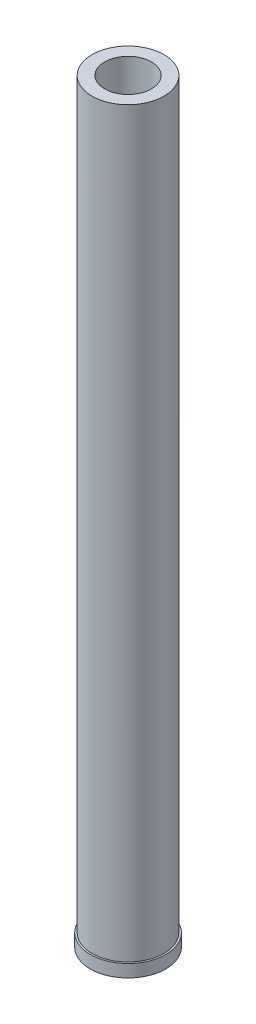
ISO-10303-21;
HEADER;
FILE_DESCRIPTION(('STEP AP214'),'2;1');
FILE_NAME('part.step','',(''),(''),'','','');
FILE_SCHEMA(('AUTOMOTIVE_DESIGN { 1 0 10303 214 1 1 1 1 }'));
ENDSEC;
DATA;
#1=APPLICATION_CONTEXT('core data for automotive mechanical design processes');
#2=APPLICATION_PROTOCOL_DEFINITION('international standard','automotive_design',2000,#1);
#3=PRODUCT_CONTEXT('',#1,'mechanical');
#4=PRODUCT('Part','Part','',(#3));
#5=PRODUCT_RELATED_PRODUCT_CATEGORY('part','',(#4));
#6=PRODUCT_DEFINITION_FORMATION('','',#4);
#7=PRODUCT_DEFINITION_CONTEXT('part definition',#1,'design');
#8=PRODUCT_DEFINITION('design','',#6,#7);
#9=PRODUCT_DEFINITION_SHAPE('','',#8);
#10=(LENGTH_UNIT() NAMED_UNIT(*) SI_UNIT(.MILLI.,.METRE.));
#11=(NAMED_UNIT(*) PLANE_ANGLE_UNIT() SI_UNIT($,.RADIAN.));
#12=(NAMED_UNIT(*) SI_UNIT($,.STERADIAN.) SOLID_ANGLE_UNIT());
#13=UNCERTAINTY_MEASURE_WITH_UNIT(LENGTH_MEASURE(1.E-05),#10,'distance_accuracy_value','');
#14=(GEOMETRIC_REPRESENTATION_CONTEXT(3) GLOBAL_UNCERTAINTY_ASSIGNED_CONTEXT((#13)) GLOBAL_UNIT_ASSIGNED_CONTEXT((#10,
#11,#12)) REPRESENTATION_CONTEXT('',''));
#15=CARTESIAN_POINT('',(0.,0.,0.));
#16=DIRECTION('',(0.,0.,1.));
#17=DIRECTION('',(1.,0.,0.));
#18=AXIS2_PLACEMENT_3D('',#15,#16,#17);
#19=CARTESIAN_POINT('',(0.,300.,0.));
#20=DIRECTION('',(0.,1.,0.));
#21=DIRECTION('',(0.,0.,1.));
#22=AXIS2_PLACEMENT_3D('',#19,#20,#21);
#23=PLANE('',#22);
#24=CARTESIAN_POINT('',(0.,300.,0.));
#25=DIRECTION('',(0.,1.,0.));
#26=DIRECTION('',(0.,0.,1.));
#27=AXIS2_PLACEMENT_3D('',#24,#25,#26);
#28=CIRCLE('',#27,14.3);
#29=CARTESIAN_POINT('',(0.,300.,14.3));
#30=VERTEX_POINT('',#29);
#31=EDGE_CURVE('E10',#30,#30,#28,.T.);
#32=ORIENTED_EDGE('',*,*,#31,.T.);
#33=EDGE_LOOP('',(#32));
#34=FACE_BOUND('',#33,.T.);
#35=CARTESIAN_POINT('',(0.,300.,0.));
#36=DIRECTION('',(0.,1.,0.));
#37=DIRECTION('',(0.,0.,1.));
#38=AXIS2_PLACEMENT_3D('',#35,#36,#37);
#39=CIRCLE('',#38,9.3);
#40=CARTESIAN_POINT('',(0.,300.,9.3));
#41=VERTEX_POINT('',#40);
#42=EDGE_CURVE('E53',#41,#41,#39,.T.);
#43=ORIENTED_EDGE('',*,*,#42,.F.);
#44=EDGE_LOOP('',(#43));
#45=FACE_BOUND('',#44,.T.);
#46=ADVANCED_FACE('F45',(#34,#45),#23,.T.);
#47=CARTESIAN_POINT('',(0.,0.,0.));
#48=DIRECTION('',(0.,1.,0.));
#49=DIRECTION('',(0.,0.,1.));
#50=AXIS2_PLACEMENT_3D('',#47,#48,#49);
#51=PLANE('',#50);
#52=CARTESIAN_POINT('',(0.,0.,0.));
#53=DIRECTION('',(0.,1.,0.));
#54=DIRECTION('',(0.,0.,1.));
#55=AXIS2_PLACEMENT_3D('',#52,#53,#54);
#56=CIRCLE('',#55,9.3);
#57=CARTESIAN_POINT('',(0.,0.,9.3));
#58=VERTEX_POINT('',#57);
#59=EDGE_CURVE('E58',#58,#58,#56,.T.);
#60=ORIENTED_EDGE('',*,*,#59,.T.);
#61=EDGE_LOOP('',(#60));
#62=FACE_BOUND('',#61,.T.);
#63=CARTESIAN_POINT('',(0.,0.,0.));
#64=DIRECTION('',(0.,-1.,0.));
#65=DIRECTION('',(1.,0.,0.));
#66=AXIS2_PLACEMENT_3D('',#63,#64,#65);
#67=CIRCLE('',#66,15.);
#68=CARTESIAN_POINT('',(15.,0.,0.));
#69=VERTEX_POINT('',#68);
#70=EDGE_CURVE('E73',#69,#69,#67,.T.);
#71=ORIENTED_EDGE('',*,*,#70,.T.);
#72=EDGE_LOOP('',(#71));
#73=FACE_BOUND('',#72,.T.);
#74=ADVANCED_FACE('F78',(#62,#73),#51,.F.);
#75=CARTESIAN_POINT('',(0.,300.,0.));
#76=DIRECTION('',(0.,-1.,0.));
#77=DIRECTION('',(0.,0.,-1.));
#78=AXIS2_PLACEMENT_3D('',#75,#76,#77);
#79=CYLINDRICAL_SURFACE('',#78,14.3);
#80=CARTESIAN_POINT('',(0.,4.99999999999999,0.));
#81=DIRECTION('',(0.,-1.,0.));
#82=DIRECTION('',(1.,0.,0.));
#83=AXIS2_PLACEMENT_3D('',#80,#81,#82);
#84=CIRCLE('',#83,14.3);
#85=CARTESIAN_POINT('',(14.3,4.99999999999999,0.));
#86=VERTEX_POINT('',#85);
#87=EDGE_CURVE('E64',#86,#86,#84,.T.);
#88=ORIENTED_EDGE('',*,*,#87,.F.);
#89=EDGE_LOOP('',(#88));
#90=FACE_BOUND('',#89,.T.);
#91=ORIENTED_EDGE('',*,*,#31,.F.);
#92=EDGE_LOOP('',(#91));
#93=FACE_BOUND('',#92,.T.);
#94=ADVANCED_FACE('F47',(#90,#93),#79,.T.);
#95=CARTESIAN_POINT('',(0.,300.,0.));
#96=DIRECTION('',(0.,-1.,0.));
#97=DIRECTION('',(0.,0.,-1.));
#98=AXIS2_PLACEMENT_3D('',#95,#96,#97);
#99=CYLINDRICAL_SURFACE('',#98,9.3);
#100=ORIENTED_EDGE('',*,*,#42,.T.);
#101=EDGE_LOOP('',(#100));
#102=FACE_BOUND('',#101,.T.);
#103=ORIENTED_EDGE('',*,*,#59,.F.);
#104=EDGE_LOOP('',(#103));
#105=FACE_BOUND('',#104,.T.);
#106=ADVANCED_FACE('F88',(#102,#105),#99,.F.);
#107=CARTESIAN_POINT('',(0.,4.99999999999999,0.));
#108=DIRECTION('',(0.,1.,0.));
#109=DIRECTION('',(-1.,0.,0.));
#110=AXIS2_PLACEMENT_3D('',#107,#108,#109);
#111=PLANE('',#110);
#112=ORIENTED_EDGE('',*,*,#87,.T.);
#113=EDGE_LOOP('',(#112));
#114=FACE_BOUND('',#113,.T.);
#115=CARTESIAN_POINT('',(0.,4.99999999999999,0.));
#116=DIRECTION('',(0.,-1.,0.));
#117=DIRECTION('',(1.,0.,0.));
#118=AXIS2_PLACEMENT_3D('',#115,#116,#117);
#119=CIRCLE('',#118,15.);
#120=CARTESIAN_POINT('',(15.,4.99999999999999,0.));
#121=VERTEX_POINT('',#120);
#122=EDGE_CURVE('E69',#121,#121,#119,.T.);
#123=ORIENTED_EDGE('',*,*,#122,.F.);
#124=EDGE_LOOP('',(#123));
#125=FACE_BOUND('',#124,.T.);
#126=ADVANCED_FACE('F83',(#114,#125),#111,.T.);
#127=CARTESIAN_POINT('',(0.,0.,0.));
#128=DIRECTION('',(0.,-1.,0.));
#129=DIRECTION('',(1.,0.,0.));
#130=AXIS2_PLACEMENT_3D('',#127,#128,#129);
#131=CYLINDRICAL_SURFACE('',#130,15.);
#132=ORIENTED_EDGE('',*,*,#70,.F.);
#133=EDGE_LOOP('',(#132));
#134=FACE_BOUND('',#133,.T.);
#135=ORIENTED_EDGE('',*,*,#122,.T.);
#136=EDGE_LOOP('',(#135));
#137=FACE_BOUND('',#136,.T.);
#138=ADVANCED_FACE('F80',(#134,#137),#131,.T.);
#139=CLOSED_SHELL('',(#46,#74,#94,#106,#126,#138));
#140=MANIFOLD_SOLID_BREP('B2',#139);
#141=ADVANCED_BREP_SHAPE_REPRESENTATION('',(#18,#140),#14);
#142=SHAPE_DEFINITION_REPRESENTATION(#9,#141);
ENDSEC;
END-ISO-10303-21;
